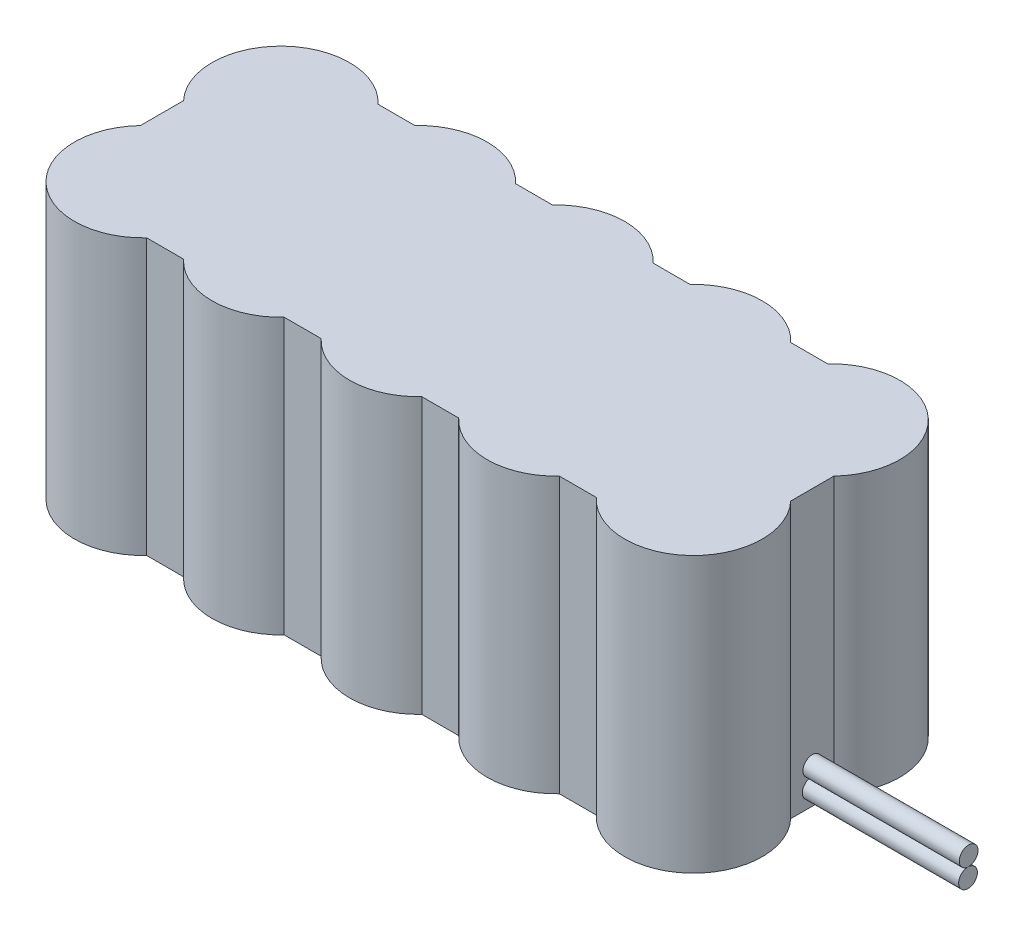
ISO-10303-21;
HEADER;
FILE_DESCRIPTION(('STEP AP214'),'2;1');
FILE_NAME('part.step','',(''),(''),'','','');
FILE_SCHEMA(('AUTOMOTIVE_DESIGN { 1 0 10303 214 1 1 1 1 }'));
ENDSEC;
DATA;
#1=APPLICATION_CONTEXT('core data for automotive mechanical design processes');
#2=APPLICATION_PROTOCOL_DEFINITION('international standard','automotive_design',2000,#1);
#3=PRODUCT_CONTEXT('',#1,'mechanical');
#4=PRODUCT('Part','Part','',(#3));
#5=PRODUCT_RELATED_PRODUCT_CATEGORY('part','',(#4));
#6=PRODUCT_DEFINITION_FORMATION('','',#4);
#7=PRODUCT_DEFINITION_CONTEXT('part definition',#1,'design');
#8=PRODUCT_DEFINITION('design','',#6,#7);
#9=PRODUCT_DEFINITION_SHAPE('','',#8);
#10=(LENGTH_UNIT() NAMED_UNIT(*) SI_UNIT(.MILLI.,.METRE.));
#11=(NAMED_UNIT(*) PLANE_ANGLE_UNIT() SI_UNIT($,.RADIAN.));
#12=(NAMED_UNIT(*) SI_UNIT($,.STERADIAN.) SOLID_ANGLE_UNIT());
#13=UNCERTAINTY_MEASURE_WITH_UNIT(LENGTH_MEASURE(1.E-05),#10,'distance_accuracy_value','');
#14=(GEOMETRIC_REPRESENTATION_CONTEXT(3) GLOBAL_UNCERTAINTY_ASSIGNED_CONTEXT((#13)) GLOBAL_UNIT_ASSIGNED_CONTEXT((#10,
#11,#12)) REPRESENTATION_CONTEXT('',''));
#15=CARTESIAN_POINT('',(0.,0.,0.));
#16=DIRECTION('',(0.,0.,1.));
#17=DIRECTION('',(1.,0.,0.));
#18=AXIS2_PLACEMENT_3D('',#15,#16,#17);
#19=CARTESIAN_POINT('',(121.,2.63932216445252,-10.9047595153091));
#20=DIRECTION('',(-1.,0.,0.));
#21=DIRECTION('',(0.,0.,1.));
#22=AXIS2_PLACEMENT_3D('',#19,#20,#21);
#23=CYLINDRICAL_SURFACE('',#22,1.5);
#24=CARTESIAN_POINT('',(121.,2.63932216445252,-10.9047595153091));
#25=DIRECTION('',(1.,0.,0.));
#26=DIRECTION('',(0.,0.,-1.));
#27=AXIS2_PLACEMENT_3D('',#24,#25,#26);
#28=CIRCLE('',#27,1.5);
#29=CARTESIAN_POINT('',(121.,2.63932216445252,-12.4047595153091));
#30=VERTEX_POINT('',#29);
#31=EDGE_CURVE('E12',#30,#30,#28,.T.);
#32=ORIENTED_EDGE('',*,*,#31,.F.);
#33=EDGE_LOOP('',(#32));
#34=FACE_BOUND('',#33,.T.);
#35=CARTESIAN_POINT('',(96.,2.63932216445252,-10.9047595153091));
#36=DIRECTION('',(1.,0.,0.));
#37=DIRECTION('',(0.,0.,-1.));
#38=AXIS2_PLACEMENT_3D('',#35,#36,#37);
#39=CIRCLE('',#38,1.5);
#40=CARTESIAN_POINT('',(96.,2.63932216445252,-12.4047595153091));
#41=VERTEX_POINT('',#40);
#42=EDGE_CURVE('E68',#41,#41,#39,.T.);
#43=ORIENTED_EDGE('',*,*,#42,.T.);
#44=EDGE_LOOP('',(#43));
#45=FACE_BOUND('',#44,.T.);
#46=ADVANCED_FACE('F65',(#34,#45),#23,.T.);
#47=CARTESIAN_POINT('',(121.,2.63932216445252,-10.9047595153091));
#48=DIRECTION('',(1.,0.,0.));
#49=DIRECTION('',(0.,0.,-1.));
#50=AXIS2_PLACEMENT_3D('',#47,#48,#49);
#51=PLANE('',#50);
#52=ORIENTED_EDGE('',*,*,#31,.T.);
#53=EDGE_LOOP('',(#52));
#54=FACE_BOUND('',#53,.T.);
#55=ADVANCED_FACE('F80',(#54),#51,.T.);
#56=CARTESIAN_POINT('',(96.,2.63932216445252,-10.9047595153091));
#57=DIRECTION('',(1.,0.,0.));
#58=DIRECTION('',(0.,0.,-1.));
#59=AXIS2_PLACEMENT_3D('',#56,#57,#58);
#60=PLANE('',#59);
#61=ORIENTED_EDGE('',*,*,#42,.F.);
#62=EDGE_LOOP('',(#61));
#63=FACE_BOUND('',#62,.T.);
#64=ADVANCED_FACE('F78',(#63),#60,.F.);
#65=CLOSED_SHELL('',(#46,#55,#64));
#66=MANIFOLD_SOLID_BREP('B2',#65);
#67=CARTESIAN_POINT('',(96.,0.,-29.5));
#68=DIRECTION('',(1.,0.,0.));
#69=DIRECTION('',(0.,0.,-1.));
#70=AXIS2_PLACEMENT_3D('',#67,#68,#69);
#71=PLANE('',#70);
#72=DIRECTION('',(0.,0.,-1.));
#73=VECTOR('',#72,1.);
#74=CARTESIAN_POINT('',(96.,0.,-29.5));
#75=LINE('',#74,#73);
#76=CARTESIAN_POINT('',(96.,0.,-7.54983443527075));
#77=VERTEX_POINT('',#76);
#78=CARTESIAN_POINT('',(96.,0.,-14.4501655647293));
#79=VERTEX_POINT('',#78);
#80=EDGE_CURVE('E349',#77,#79,#75,.T.);
#81=ORIENTED_EDGE('',*,*,#80,.T.);
#82=DIRECTION('',(0.,-1.,0.));
#83=VECTOR('',#82,1.);
#84=CARTESIAN_POINT('',(96.,44.,-14.4501655647293));
#85=LINE('',#84,#83);
#86=CARTESIAN_POINT('',(96.,44.,-14.4501655647293));
#87=VERTEX_POINT('',#86);
#88=EDGE_CURVE('E337',#79,#87,#85,.F.);
#89=ORIENTED_EDGE('',*,*,#88,.T.);
#90=DIRECTION('',(0.,0.,-1.));
#91=VECTOR('',#90,1.);
#92=CARTESIAN_POINT('',(96.,44.,-29.5));
#93=LINE('',#92,#91);
#94=CARTESIAN_POINT('',(96.,44.,-7.54983443527075));
#95=VERTEX_POINT('',#94);
#96=EDGE_CURVE('E361',#95,#87,#93,.T.);
#97=ORIENTED_EDGE('',*,*,#96,.F.);
#98=DIRECTION('',(0.,-1.,0.));
#99=VECTOR('',#98,1.);
#100=CARTESIAN_POINT('',(96.,44.,-7.54983443527075));
#101=LINE('',#100,#99);
#102=EDGE_CURVE('E371',#77,#95,#101,.F.);
#103=ORIENTED_EDGE('',*,*,#102,.F.);
#104=EDGE_LOOP('',(#81,#89,#97,#103));
#105=FACE_BOUND('',#104,.T.);
#106=CARTESIAN_POINT('',(96.,5.63932216445252,-11.));
#107=DIRECTION('',(1.,0.,0.));
#108=DIRECTION('',(0.,0.,-1.));
#109=AXIS2_PLACEMENT_3D('',#106,#107,#108);
#110=CIRCLE('',#109,1.5);
#111=CARTESIAN_POINT('',(96.,5.63932216445252,-12.5));
#112=VERTEX_POINT('',#111);
#113=EDGE_CURVE('E266',#112,#112,#110,.T.);
#114=ORIENTED_EDGE('',*,*,#113,.F.);
#115=EDGE_LOOP('',(#114));
#116=FACE_BOUND('',#115,.T.);
#117=ADVANCED_FACE('F106',(#105,#116),#71,.T.);
#118=CARTESIAN_POINT('',(-8.,0.,-29.5));
#119=DIRECTION('',(0.,0.,-1.));
#120=DIRECTION('',(-1.,0.,0.));
#121=AXIS2_PLACEMENT_3D('',#118,#119,#120);
#122=PLANE('',#121);
#123=DIRECTION('',(-1.,0.,0.));
#124=VECTOR('',#123,1.);
#125=CARTESIAN_POINT('',(-8.,0.,-29.5));
#126=LINE('',#125,#124);
#127=CARTESIAN_POINT('',(13.9532615302845,0.,-29.5));
#128=VERTEX_POINT('',#127);
#129=CARTESIAN_POINT('',(8.04673846971554,0.,-29.5));
#130=VERTEX_POINT('',#129);
#131=EDGE_CURVE('E352',#128,#130,#126,.T.);
#132=ORIENTED_EDGE('',*,*,#131,.T.);
#133=DIRECTION('',(0.,-1.,0.));
#134=VECTOR('',#133,1.);
#135=CARTESIAN_POINT('',(8.04673846971554,44.,-29.5));
#136=LINE('',#135,#134);
#137=CARTESIAN_POINT('',(8.04673846971554,44.,-29.5));
#138=VERTEX_POINT('',#137);
#139=EDGE_CURVE('E128',#130,#138,#136,.F.);
#140=ORIENTED_EDGE('',*,*,#139,.T.);
#141=DIRECTION('',(-1.,0.,0.));
#142=VECTOR('',#141,1.);
#143=CARTESIAN_POINT('',(-8.,44.,-29.5));
#144=LINE('',#143,#142);
#145=CARTESIAN_POINT('',(13.9532615302845,44.,-29.5));
#146=VERTEX_POINT('',#145);
#147=EDGE_CURVE('E365',#146,#138,#144,.T.);
#148=ORIENTED_EDGE('',*,*,#147,.F.);
#149=DIRECTION('',(0.,-1.,0.));
#150=VECTOR('',#149,1.);
#151=CARTESIAN_POINT('',(13.9532615302845,44.,-29.5));
#152=LINE('',#151,#150);
#153=EDGE_CURVE('E274',#146,#128,#152,.T.);
#154=ORIENTED_EDGE('',*,*,#153,.T.);
#155=EDGE_LOOP('',(#132,#140,#148,#154));
#156=FACE_BOUND('',#155,.T.);
#157=ADVANCED_FACE('F459',(#156),#122,.T.);
#158=CARTESIAN_POINT('',(-8.,0.,-29.5));
#159=DIRECTION('',(-1.,0.,0.));
#160=DIRECTION('',(0.,0.,1.));
#161=AXIS2_PLACEMENT_3D('',#158,#159,#160);
#162=PLANE('',#161);
#163=DIRECTION('',(0.,0.,1.));
#164=VECTOR('',#163,1.);
#165=CARTESIAN_POINT('',(-8.,44.,-29.5));
#166=LINE('',#165,#164);
#167=CARTESIAN_POINT('',(-8.,44.,-14.4501655647293));
#168=VERTEX_POINT('',#167);
#169=CARTESIAN_POINT('',(-8.,44.,-7.54983443527075));
#170=VERTEX_POINT('',#169);
#171=EDGE_CURVE('E120',#168,#170,#166,.T.);
#172=ORIENTED_EDGE('',*,*,#171,.F.);
#173=DIRECTION('',(0.,-1.,0.));
#174=VECTOR('',#173,1.);
#175=CARTESIAN_POINT('',(-8.,44.,-14.4501655647293));
#176=LINE('',#175,#174);
#177=CARTESIAN_POINT('',(-8.,0.,-14.4501655647293));
#178=VERTEX_POINT('',#177);
#179=EDGE_CURVE('E254',#168,#178,#176,.T.);
#180=ORIENTED_EDGE('',*,*,#179,.T.);
#181=DIRECTION('',(0.,0.,1.));
#182=VECTOR('',#181,1.);
#183=CARTESIAN_POINT('',(-8.,0.,-29.5));
#184=LINE('',#183,#182);
#185=CARTESIAN_POINT('',(-8.,0.,-7.54983443527075));
#186=VERTEX_POINT('',#185);
#187=EDGE_CURVE('E243',#178,#186,#184,.T.);
#188=ORIENTED_EDGE('',*,*,#187,.T.);
#189=DIRECTION('',(0.,-1.,0.));
#190=VECTOR('',#189,1.);
#191=CARTESIAN_POINT('',(-8.,44.,-7.54983443527075));
#192=LINE('',#191,#190);
#193=EDGE_CURVE('E63',#186,#170,#192,.F.);
#194=ORIENTED_EDGE('',*,*,#193,.T.);
#195=EDGE_LOOP('',(#172,#180,#188,#194));
#196=FACE_BOUND('',#195,.T.);
#197=ADVANCED_FACE('F255',(#196),#162,.T.);
#198=CARTESIAN_POINT('',(35.9532615302845,0.,-29.5));
#199=VERTEX_POINT('',#198);
#200=CARTESIAN_POINT('',(30.0467384697155,0.,-29.5));
#201=VERTEX_POINT('',#200);
#202=EDGE_CURVE('E454',#199,#201,#126,.T.);
#203=ORIENTED_EDGE('',*,*,#202,.T.);
#204=DIRECTION('',(0.,-1.,0.));
#205=VECTOR('',#204,1.);
#206=CARTESIAN_POINT('',(30.0467384697155,44.,-29.5));
#207=LINE('',#206,#205);
#208=CARTESIAN_POINT('',(30.0467384697155,44.,-29.5));
#209=VERTEX_POINT('',#208);
#210=EDGE_CURVE('E279',#201,#209,#207,.F.);
#211=ORIENTED_EDGE('',*,*,#210,.T.);
#212=CARTESIAN_POINT('',(35.9532615302845,44.,-29.5));
#213=VERTEX_POINT('',#212);
#214=EDGE_CURVE('E445',#213,#209,#144,.T.);
#215=ORIENTED_EDGE('',*,*,#214,.F.);
#216=DIRECTION('',(0.,-1.,0.));
#217=VECTOR('',#216,1.);
#218=CARTESIAN_POINT('',(35.9532615302845,44.,-29.5));
#219=LINE('',#218,#217);
#220=EDGE_CURVE('E291',#213,#199,#219,.T.);
#221=ORIENTED_EDGE('',*,*,#220,.T.);
#222=EDGE_LOOP('',(#203,#211,#215,#221));
#223=FACE_BOUND('',#222,.T.);
#224=ADVANCED_FACE('F453',(#223),#122,.T.);
#225=CARTESIAN_POINT('',(-8.,0.,7.5));
#226=DIRECTION('',(0.,0.,1.));
#227=DIRECTION('',(1.,0.,0.));
#228=AXIS2_PLACEMENT_3D('',#225,#226,#227);
#229=PLANE('',#228);
#230=DIRECTION('',(1.,0.,0.));
#231=VECTOR('',#230,1.);
#232=CARTESIAN_POINT('',(-8.,44.,7.5));
#233=LINE('',#232,#231);
#234=CARTESIAN_POINT('',(8.04673846971554,44.,7.5));
#235=VERTEX_POINT('',#234);
#236=CARTESIAN_POINT('',(13.9532615302845,44.,7.5));
#237=VERTEX_POINT('',#236);
#238=EDGE_CURVE('E359',#235,#237,#233,.T.);
#239=ORIENTED_EDGE('',*,*,#238,.F.);
#240=DIRECTION('',(0.,-1.,0.));
#241=VECTOR('',#240,1.);
#242=CARTESIAN_POINT('',(8.04673846971554,44.,7.5));
#243=LINE('',#242,#241);
#244=CARTESIAN_POINT('',(8.04673846971554,0.,7.5));
#245=VERTEX_POINT('',#244);
#246=EDGE_CURVE('E283',#235,#245,#243,.T.);
#247=ORIENTED_EDGE('',*,*,#246,.T.);
#248=DIRECTION('',(1.,0.,0.));
#249=VECTOR('',#248,1.);
#250=CARTESIAN_POINT('',(-8.,0.,7.5));
#251=LINE('',#250,#249);
#252=CARTESIAN_POINT('',(13.9532615302845,0.,7.5));
#253=VERTEX_POINT('',#252);
#254=EDGE_CURVE('E347',#245,#253,#251,.T.);
#255=ORIENTED_EDGE('',*,*,#254,.T.);
#256=DIRECTION('',(0.,-1.,0.));
#257=VECTOR('',#256,1.);
#258=CARTESIAN_POINT('',(13.9532615302845,44.,7.5));
#259=LINE('',#258,#257);
#260=EDGE_CURVE('E307',#253,#237,#259,.F.);
#261=ORIENTED_EDGE('',*,*,#260,.T.);
#262=EDGE_LOOP('',(#239,#247,#255,#261));
#263=FACE_BOUND('',#262,.T.);
#264=ADVANCED_FACE('F470',(#263),#229,.T.);
#265=CARTESIAN_POINT('',(57.9532615302845,0.,-29.5));
#266=VERTEX_POINT('',#265);
#267=CARTESIAN_POINT('',(52.0467384697155,0.,-29.5));
#268=VERTEX_POINT('',#267);
#269=EDGE_CURVE('E356',#266,#268,#126,.T.);
#270=ORIENTED_EDGE('',*,*,#269,.T.);
#271=DIRECTION('',(0.,-1.,0.));
#272=VECTOR('',#271,1.);
#273=CARTESIAN_POINT('',(52.0467384697155,44.,-29.5));
#274=LINE('',#273,#272);
#275=CARTESIAN_POINT('',(52.0467384697155,44.,-29.5));
#276=VERTEX_POINT('',#275);
#277=EDGE_CURVE('E296',#268,#276,#274,.F.);
#278=ORIENTED_EDGE('',*,*,#277,.T.);
#279=CARTESIAN_POINT('',(57.9532615302845,44.,-29.5));
#280=VERTEX_POINT('',#279);
#281=EDGE_CURVE('E368',#280,#276,#144,.T.);
#282=ORIENTED_EDGE('',*,*,#281,.F.);
#283=DIRECTION('',(0.,-1.,0.));
#284=VECTOR('',#283,1.);
#285=CARTESIAN_POINT('',(57.9532615302845,44.,-29.5));
#286=LINE('',#285,#284);
#287=EDGE_CURVE('E314',#280,#266,#286,.T.);
#288=ORIENTED_EDGE('',*,*,#287,.T.);
#289=EDGE_LOOP('',(#270,#278,#282,#288));
#290=FACE_BOUND('',#289,.T.);
#291=ADVANCED_FACE('F471',(#290),#122,.T.);
#292=CARTESIAN_POINT('',(30.0467384697155,44.,7.5));
#293=VERTEX_POINT('',#292);
#294=CARTESIAN_POINT('',(35.9532615302845,44.,7.5));
#295=VERTEX_POINT('',#294);
#296=EDGE_CURVE('E362',#293,#295,#233,.T.);
#297=ORIENTED_EDGE('',*,*,#296,.F.);
#298=DIRECTION('',(0.,-1.,0.));
#299=VECTOR('',#298,1.);
#300=CARTESIAN_POINT('',(30.0467384697155,44.,7.5));
#301=LINE('',#300,#299);
#302=CARTESIAN_POINT('',(30.0467384697155,0.,7.5));
#303=VERTEX_POINT('',#302);
#304=EDGE_CURVE('E302',#293,#303,#301,.T.);
#305=ORIENTED_EDGE('',*,*,#304,.T.);
#306=CARTESIAN_POINT('',(35.9532615302845,0.,7.5));
#307=VERTEX_POINT('',#306);
#308=EDGE_CURVE('E350',#303,#307,#251,.T.);
#309=ORIENTED_EDGE('',*,*,#308,.T.);
#310=DIRECTION('',(0.,-1.,0.));
#311=VECTOR('',#310,1.);
#312=CARTESIAN_POINT('',(35.9532615302845,44.,7.5));
#313=LINE('',#312,#311);
#314=EDGE_CURVE('E330',#307,#295,#313,.F.);
#315=ORIENTED_EDGE('',*,*,#314,.T.);
#316=EDGE_LOOP('',(#297,#305,#309,#315));
#317=FACE_BOUND('',#316,.T.);
#318=ADVANCED_FACE('F427',(#317),#229,.T.);
#319=CARTESIAN_POINT('',(79.9532615302845,0.,-29.5));
#320=VERTEX_POINT('',#319);
#321=CARTESIAN_POINT('',(74.0467384697155,0.,-29.5));
#322=VERTEX_POINT('',#321);
#323=EDGE_CURVE('E353',#320,#322,#126,.T.);
#324=ORIENTED_EDGE('',*,*,#323,.T.);
#325=DIRECTION('',(0.,-1.,0.));
#326=VECTOR('',#325,1.);
#327=CARTESIAN_POINT('',(74.0467384697155,44.,-29.5));
#328=LINE('',#327,#326);
#329=CARTESIAN_POINT('',(74.0467384697155,44.,-29.5));
#330=VERTEX_POINT('',#329);
#331=EDGE_CURVE('E319',#322,#330,#328,.F.);
#332=ORIENTED_EDGE('',*,*,#331,.T.);
#333=CARTESIAN_POINT('',(79.9532615302844,44.,-29.5));
#334=VERTEX_POINT('',#333);
#335=EDGE_CURVE('E252',#334,#330,#144,.T.);
#336=ORIENTED_EDGE('',*,*,#335,.F.);
#337=DIRECTION('',(0.,-1.,0.));
#338=VECTOR('',#337,1.);
#339=CARTESIAN_POINT('',(79.9532615302845,44.,-29.5));
#340=LINE('',#339,#338);
#341=EDGE_CURVE('E114',#334,#320,#340,.T.);
#342=ORIENTED_EDGE('',*,*,#341,.T.);
#343=EDGE_LOOP('',(#324,#332,#336,#342));
#344=FACE_BOUND('',#343,.T.);
#345=ADVANCED_FACE('F388',(#344),#122,.T.);
#346=CARTESIAN_POINT('',(52.0467384697155,44.,7.5));
#347=VERTEX_POINT('',#346);
#348=CARTESIAN_POINT('',(57.9532615302845,44.,7.5));
#349=VERTEX_POINT('',#348);
#350=EDGE_CURVE('E422',#347,#349,#233,.T.);
#351=ORIENTED_EDGE('',*,*,#350,.F.);
#352=DIRECTION('',(0.,-1.,0.));
#353=VECTOR('',#352,1.);
#354=CARTESIAN_POINT('',(52.0467384697155,44.,7.5));
#355=LINE('',#354,#353);
#356=CARTESIAN_POINT('',(52.0467384697155,0.,7.5));
#357=VERTEX_POINT('',#356);
#358=EDGE_CURVE('E325',#347,#357,#355,.T.);
#359=ORIENTED_EDGE('',*,*,#358,.T.);
#360=CARTESIAN_POINT('',(57.9532615302845,0.,7.5));
#361=VERTEX_POINT('',#360);
#362=EDGE_CURVE('E413',#357,#361,#251,.T.);
#363=ORIENTED_EDGE('',*,*,#362,.T.);
#364=DIRECTION('',(0.,-1.,0.));
#365=VECTOR('',#364,1.);
#366=CARTESIAN_POINT('',(57.9532615302845,44.,7.5));
#367=LINE('',#366,#365);
#368=EDGE_CURVE('E383',#361,#349,#367,.F.);
#369=ORIENTED_EDGE('',*,*,#368,.T.);
#370=EDGE_LOOP('',(#351,#359,#363,#369));
#371=FACE_BOUND('',#370,.T.);
#372=ADVANCED_FACE('F421',(#371),#229,.T.);
#373=CARTESIAN_POINT('',(74.0467384697155,44.,7.5));
#374=VERTEX_POINT('',#373);
#375=CARTESIAN_POINT('',(79.9532615302845,44.,7.5));
#376=VERTEX_POINT('',#375);
#377=EDGE_CURVE('E358',#374,#376,#233,.T.);
#378=ORIENTED_EDGE('',*,*,#377,.F.);
#379=DIRECTION('',(0.,-1.,0.));
#380=VECTOR('',#379,1.);
#381=CARTESIAN_POINT('',(74.0467384697155,44.,7.5));
#382=LINE('',#381,#380);
#383=CARTESIAN_POINT('',(74.0467384697155,0.,7.5));
#384=VERTEX_POINT('',#383);
#385=EDGE_CURVE('E378',#374,#384,#382,.T.);
#386=ORIENTED_EDGE('',*,*,#385,.T.);
#387=CARTESIAN_POINT('',(79.9532615302845,0.,7.5));
#388=VERTEX_POINT('',#387);
#389=EDGE_CURVE('E251',#384,#388,#251,.T.);
#390=ORIENTED_EDGE('',*,*,#389,.T.);
#391=DIRECTION('',(0.,-1.,0.));
#392=VECTOR('',#391,1.);
#393=CARTESIAN_POINT('',(79.9532615302845,44.,7.5));
#394=LINE('',#393,#392);
#395=EDGE_CURVE('E355',#376,#388,#394,.T.);
#396=ORIENTED_EDGE('',*,*,#395,.F.);
#397=EDGE_LOOP('',(#378,#386,#390,#396));
#398=FACE_BOUND('',#397,.T.);
#399=ADVANCED_FACE('F415',(#398),#229,.T.);
#400=CARTESIAN_POINT('',(88.,44.,0.));
#401=DIRECTION('',(0.,-1.,0.));
#402=DIRECTION('',(0.,0.,-1.));
#403=AXIS2_PLACEMENT_3D('',#400,#401,#402);
#404=CYLINDRICAL_SURFACE('',#403,11.);
#405=CARTESIAN_POINT('',(88.,0.,0.));
#406=DIRECTION('',(0.,1.,0.));
#407=DIRECTION('',(1.,0.,0.));
#408=AXIS2_PLACEMENT_3D('',#405,#406,#407);
#409=CIRCLE('',#408,11.);
#410=EDGE_CURVE('E374',#388,#77,#409,.T.);
#411=ORIENTED_EDGE('',*,*,#410,.T.);
#412=ORIENTED_EDGE('',*,*,#102,.T.);
#413=CARTESIAN_POINT('',(88.,44.,0.));
#414=DIRECTION('',(0.,1.,0.));
#415=DIRECTION('',(1.,0.,0.));
#416=AXIS2_PLACEMENT_3D('',#413,#414,#415);
#417=CIRCLE('',#416,11.);
#418=EDGE_CURVE('E375',#376,#95,#417,.T.);
#419=ORIENTED_EDGE('',*,*,#418,.F.);
#420=ORIENTED_EDGE('',*,*,#395,.T.);
#421=EDGE_LOOP('',(#411,#412,#419,#420));
#422=FACE_BOUND('',#421,.T.);
#423=ADVANCED_FACE('F108',(#422),#404,.T.);
#424=CARTESIAN_POINT('',(88.,44.,0.));
#425=DIRECTION('',(0.,1.,0.));
#426=DIRECTION('',(1.,0.,0.));
#427=AXIS2_PLACEMENT_3D('',#424,#425,#426);
#428=PLANE('',#427);
#429=ORIENTED_EDGE('',*,*,#147,.T.);
#430=CARTESIAN_POINT('',(0.,44.,-22.));
#431=DIRECTION('',(0.,1.,0.));
#432=DIRECTION('',(1.,0.,0.));
#433=AXIS2_PLACEMENT_3D('',#430,#431,#432);
#434=CIRCLE('',#433,11.);
#435=EDGE_CURVE('E261',#138,#168,#434,.T.);
#436=ORIENTED_EDGE('',*,*,#435,.T.);
#437=ORIENTED_EDGE('',*,*,#171,.T.);
#438=CARTESIAN_POINT('',(0.,44.,0.));
#439=DIRECTION('',(0.,1.,0.));
#440=DIRECTION('',(1.,0.,0.));
#441=AXIS2_PLACEMENT_3D('',#438,#439,#440);
#442=CIRCLE('',#441,11.);
#443=EDGE_CURVE('E281',#170,#235,#442,.T.);
#444=ORIENTED_EDGE('',*,*,#443,.T.);
#445=ORIENTED_EDGE('',*,*,#238,.T.);
#446=CARTESIAN_POINT('',(22.,44.,0.));
#447=DIRECTION('',(0.,1.,0.));
#448=DIRECTION('',(1.,0.,0.));
#449=AXIS2_PLACEMENT_3D('',#446,#447,#448);
#450=CIRCLE('',#449,11.);
#451=EDGE_CURVE('E298',#237,#293,#450,.T.);
#452=ORIENTED_EDGE('',*,*,#451,.T.);
#453=ORIENTED_EDGE('',*,*,#296,.T.);
#454=CARTESIAN_POINT('',(44.,44.,0.));
#455=DIRECTION('',(0.,1.,0.));
#456=DIRECTION('',(1.,0.,0.));
#457=AXIS2_PLACEMENT_3D('',#454,#455,#456);
#458=CIRCLE('',#457,11.);
#459=EDGE_CURVE('E321',#295,#347,#458,.T.);
#460=ORIENTED_EDGE('',*,*,#459,.T.);
#461=ORIENTED_EDGE('',*,*,#350,.T.);
#462=CARTESIAN_POINT('',(66.,44.,0.));
#463=DIRECTION('',(0.,1.,0.));
#464=DIRECTION('',(1.,0.,0.));
#465=AXIS2_PLACEMENT_3D('',#462,#463,#464);
#466=CIRCLE('',#465,11.);
#467=EDGE_CURVE('E341',#349,#374,#466,.T.);
#468=ORIENTED_EDGE('',*,*,#467,.T.);
#469=ORIENTED_EDGE('',*,*,#377,.T.);
#470=ORIENTED_EDGE('',*,*,#418,.T.);
#471=ORIENTED_EDGE('',*,*,#96,.T.);
#472=CARTESIAN_POINT('',(88.,44.,-22.));
#473=DIRECTION('',(0.,1.,0.));
#474=DIRECTION('',(1.,0.,0.));
#475=AXIS2_PLACEMENT_3D('',#472,#473,#474);
#476=CIRCLE('',#475,11.);
#477=EDGE_CURVE('E333',#87,#334,#476,.T.);
#478=ORIENTED_EDGE('',*,*,#477,.T.);
#479=ORIENTED_EDGE('',*,*,#335,.T.);
#480=CARTESIAN_POINT('',(66.,44.,-22.));
#481=DIRECTION('',(0.,1.,0.));
#482=DIRECTION('',(1.,0.,0.));
#483=AXIS2_PLACEMENT_3D('',#480,#481,#482);
#484=CIRCLE('',#483,11.);
#485=EDGE_CURVE('E310',#330,#280,#484,.T.);
#486=ORIENTED_EDGE('',*,*,#485,.T.);
#487=ORIENTED_EDGE('',*,*,#281,.T.);
#488=CARTESIAN_POINT('',(44.,44.,-22.));
#489=DIRECTION('',(0.,1.,0.));
#490=DIRECTION('',(1.,0.,0.));
#491=AXIS2_PLACEMENT_3D('',#488,#489,#490);
#492=CIRCLE('',#491,11.);
#493=EDGE_CURVE('E287',#276,#213,#492,.T.);
#494=ORIENTED_EDGE('',*,*,#493,.T.);
#495=ORIENTED_EDGE('',*,*,#214,.T.);
#496=CARTESIAN_POINT('',(22.,44.,-22.));
#497=DIRECTION('',(0.,1.,0.));
#498=DIRECTION('',(1.,0.,0.));
#499=AXIS2_PLACEMENT_3D('',#496,#497,#498);
#500=CIRCLE('',#499,11.);
#501=EDGE_CURVE('E270',#209,#146,#500,.T.);
#502=ORIENTED_EDGE('',*,*,#501,.T.);
#503=EDGE_LOOP('',(#429,#436,#437,#444,#445,#452,#453,#460,#461,#468,#469,#470,#471,#478,#479,
#486,#487,#494,#495,#502));
#504=FACE_BOUND('',#503,.T.);
#505=ADVANCED_FACE('F404',(#504),#428,.T.);
#506=CARTESIAN_POINT('',(88.,0.,0.));
#507=DIRECTION('',(0.,1.,0.));
#508=DIRECTION('',(1.,0.,0.));
#509=AXIS2_PLACEMENT_3D('',#506,#507,#508);
#510=PLANE('',#509);
#511=CARTESIAN_POINT('',(0.,0.,-22.));
#512=DIRECTION('',(0.,1.,0.));
#513=DIRECTION('',(1.,0.,0.));
#514=AXIS2_PLACEMENT_3D('',#511,#512,#513);
#515=CIRCLE('',#514,11.);
#516=EDGE_CURVE('E246',#130,#178,#515,.T.);
#517=ORIENTED_EDGE('',*,*,#516,.F.);
#518=ORIENTED_EDGE('',*,*,#131,.F.);
#519=CARTESIAN_POINT('',(22.,0.,-22.));
#520=DIRECTION('',(0.,1.,0.));
#521=DIRECTION('',(1.,0.,0.));
#522=AXIS2_PLACEMENT_3D('',#519,#520,#521);
#523=CIRCLE('',#522,11.);
#524=EDGE_CURVE('E271',#201,#128,#523,.T.);
#525=ORIENTED_EDGE('',*,*,#524,.F.);
#526=ORIENTED_EDGE('',*,*,#202,.F.);
#527=CARTESIAN_POINT('',(44.,0.,-22.));
#528=DIRECTION('',(0.,1.,0.));
#529=DIRECTION('',(1.,0.,0.));
#530=AXIS2_PLACEMENT_3D('',#527,#528,#529);
#531=CIRCLE('',#530,11.);
#532=EDGE_CURVE('E288',#268,#199,#531,.T.);
#533=ORIENTED_EDGE('',*,*,#532,.F.);
#534=ORIENTED_EDGE('',*,*,#269,.F.);
#535=CARTESIAN_POINT('',(66.,0.,-22.));
#536=DIRECTION('',(0.,1.,0.));
#537=DIRECTION('',(1.,0.,0.));
#538=AXIS2_PLACEMENT_3D('',#535,#536,#537);
#539=CIRCLE('',#538,11.);
#540=EDGE_CURVE('E311',#322,#266,#539,.T.);
#541=ORIENTED_EDGE('',*,*,#540,.F.);
#542=ORIENTED_EDGE('',*,*,#323,.F.);
#543=CARTESIAN_POINT('',(88.,0.,-22.));
#544=DIRECTION('',(0.,1.,0.));
#545=DIRECTION('',(1.,0.,0.));
#546=AXIS2_PLACEMENT_3D('',#543,#544,#545);
#547=CIRCLE('',#546,11.);
#548=EDGE_CURVE('E334',#79,#320,#547,.T.);
#549=ORIENTED_EDGE('',*,*,#548,.F.);
#550=ORIENTED_EDGE('',*,*,#80,.F.);
#551=ORIENTED_EDGE('',*,*,#410,.F.);
#552=ORIENTED_EDGE('',*,*,#389,.F.);
#553=CARTESIAN_POINT('',(66.,0.,0.));
#554=DIRECTION('',(0.,1.,0.));
#555=DIRECTION('',(1.,0.,0.));
#556=AXIS2_PLACEMENT_3D('',#553,#554,#555);
#557=CIRCLE('',#556,11.);
#558=EDGE_CURVE('E342',#361,#384,#557,.T.);
#559=ORIENTED_EDGE('',*,*,#558,.F.);
#560=ORIENTED_EDGE('',*,*,#362,.F.);
#561=CARTESIAN_POINT('',(44.,0.,0.));
#562=DIRECTION('',(0.,1.,0.));
#563=DIRECTION('',(1.,0.,0.));
#564=AXIS2_PLACEMENT_3D('',#561,#562,#563);
#565=CIRCLE('',#564,11.);
#566=EDGE_CURVE('E322',#307,#357,#565,.T.);
#567=ORIENTED_EDGE('',*,*,#566,.F.);
#568=ORIENTED_EDGE('',*,*,#308,.F.);
#569=CARTESIAN_POINT('',(22.,0.,0.));
#570=DIRECTION('',(0.,1.,0.));
#571=DIRECTION('',(1.,0.,0.));
#572=AXIS2_PLACEMENT_3D('',#569,#570,#571);
#573=CIRCLE('',#572,11.);
#574=EDGE_CURVE('E299',#253,#303,#573,.T.);
#575=ORIENTED_EDGE('',*,*,#574,.F.);
#576=ORIENTED_EDGE('',*,*,#254,.F.);
#577=CARTESIAN_POINT('',(0.,0.,0.));
#578=DIRECTION('',(0.,1.,0.));
#579=DIRECTION('',(1.,0.,0.));
#580=AXIS2_PLACEMENT_3D('',#577,#578,#579);
#581=CIRCLE('',#580,11.);
#582=EDGE_CURVE('E249',#186,#245,#581,.T.);
#583=ORIENTED_EDGE('',*,*,#582,.F.);
#584=ORIENTED_EDGE('',*,*,#187,.F.);
#585=EDGE_LOOP('',(#517,#518,#525,#526,#533,#534,#541,#542,#549,#550,#551,#552,#559,#560,#567,
#568,#575,#576,#583,#584));
#586=FACE_BOUND('',#585,.T.);
#587=ADVANCED_FACE('F244',(#586),#510,.F.);
#588=CARTESIAN_POINT('',(66.,44.,0.));
#589=DIRECTION('',(0.,-1.,0.));
#590=DIRECTION('',(0.,0.,-1.));
#591=AXIS2_PLACEMENT_3D('',#588,#589,#590);
#592=CYLINDRICAL_SURFACE('',#591,11.);
#593=ORIENTED_EDGE('',*,*,#368,.F.);
#594=ORIENTED_EDGE('',*,*,#558,.T.);
#595=ORIENTED_EDGE('',*,*,#385,.F.);
#596=ORIENTED_EDGE('',*,*,#467,.F.);
#597=EDGE_LOOP('',(#593,#594,#595,#596));
#598=FACE_BOUND('',#597,.T.);
#599=ADVANCED_FACE('F419',(#598),#592,.T.);
#600=CARTESIAN_POINT('',(88.,44.,-22.));
#601=DIRECTION('',(0.,-1.,0.));
#602=DIRECTION('',(0.,0.,-1.));
#603=AXIS2_PLACEMENT_3D('',#600,#601,#602);
#604=CYLINDRICAL_SURFACE('',#603,11.);
#605=ORIENTED_EDGE('',*,*,#88,.F.);
#606=ORIENTED_EDGE('',*,*,#548,.T.);
#607=ORIENTED_EDGE('',*,*,#341,.F.);
#608=ORIENTED_EDGE('',*,*,#477,.F.);
#609=EDGE_LOOP('',(#605,#606,#607,#608));
#610=FACE_BOUND('',#609,.T.);
#611=ADVANCED_FACE('F394',(#610),#604,.T.);
#612=CARTESIAN_POINT('',(44.,44.,0.));
#613=DIRECTION('',(0.,-1.,0.));
#614=DIRECTION('',(0.,0.,-1.));
#615=AXIS2_PLACEMENT_3D('',#612,#613,#614);
#616=CYLINDRICAL_SURFACE('',#615,11.);
#617=ORIENTED_EDGE('',*,*,#314,.F.);
#618=ORIENTED_EDGE('',*,*,#566,.T.);
#619=ORIENTED_EDGE('',*,*,#358,.F.);
#620=ORIENTED_EDGE('',*,*,#459,.F.);
#621=EDGE_LOOP('',(#617,#618,#619,#620));
#622=FACE_BOUND('',#621,.T.);
#623=ADVANCED_FACE('F432',(#622),#616,.T.);
#624=CARTESIAN_POINT('',(66.,44.,-22.));
#625=DIRECTION('',(0.,-1.,0.));
#626=DIRECTION('',(0.,0.,-1.));
#627=AXIS2_PLACEMENT_3D('',#624,#625,#626);
#628=CYLINDRICAL_SURFACE('',#627,11.);
#629=ORIENTED_EDGE('',*,*,#331,.F.);
#630=ORIENTED_EDGE('',*,*,#540,.T.);
#631=ORIENTED_EDGE('',*,*,#287,.F.);
#632=ORIENTED_EDGE('',*,*,#485,.F.);
#633=EDGE_LOOP('',(#629,#630,#631,#632));
#634=FACE_BOUND('',#633,.T.);
#635=ADVANCED_FACE('F401',(#634),#628,.T.);
#636=CARTESIAN_POINT('',(22.,44.,0.));
#637=DIRECTION('',(0.,-1.,0.));
#638=DIRECTION('',(0.,0.,-1.));
#639=AXIS2_PLACEMENT_3D('',#636,#637,#638);
#640=CYLINDRICAL_SURFACE('',#639,11.);
#641=ORIENTED_EDGE('',*,*,#260,.F.);
#642=ORIENTED_EDGE('',*,*,#574,.T.);
#643=ORIENTED_EDGE('',*,*,#304,.F.);
#644=ORIENTED_EDGE('',*,*,#451,.F.);
#645=EDGE_LOOP('',(#641,#642,#643,#644));
#646=FACE_BOUND('',#645,.T.);
#647=ADVANCED_FACE('F436',(#646),#640,.T.);
#648=CARTESIAN_POINT('',(44.,44.,-22.));
#649=DIRECTION('',(0.,-1.,0.));
#650=DIRECTION('',(0.,0.,-1.));
#651=AXIS2_PLACEMENT_3D('',#648,#649,#650);
#652=CYLINDRICAL_SURFACE('',#651,11.);
#653=ORIENTED_EDGE('',*,*,#277,.F.);
#654=ORIENTED_EDGE('',*,*,#532,.T.);
#655=ORIENTED_EDGE('',*,*,#220,.F.);
#656=ORIENTED_EDGE('',*,*,#493,.F.);
#657=EDGE_LOOP('',(#653,#654,#655,#656));
#658=FACE_BOUND('',#657,.T.);
#659=ADVANCED_FACE('F451',(#658),#652,.T.);
#660=CARTESIAN_POINT('',(0.,44.,0.));
#661=DIRECTION('',(0.,-1.,0.));
#662=DIRECTION('',(0.,0.,-1.));
#663=AXIS2_PLACEMENT_3D('',#660,#661,#662);
#664=CYLINDRICAL_SURFACE('',#663,11.);
#665=ORIENTED_EDGE('',*,*,#246,.F.);
#666=ORIENTED_EDGE('',*,*,#443,.F.);
#667=ORIENTED_EDGE('',*,*,#193,.F.);
#668=ORIENTED_EDGE('',*,*,#582,.T.);
#669=EDGE_LOOP('',(#665,#666,#667,#668));
#670=FACE_BOUND('',#669,.T.);
#671=ADVANCED_FACE('F440',(#670),#664,.T.);
#672=CARTESIAN_POINT('',(22.,44.,-22.));
#673=DIRECTION('',(0.,-1.,0.));
#674=DIRECTION('',(0.,0.,-1.));
#675=AXIS2_PLACEMENT_3D('',#672,#673,#674);
#676=CYLINDRICAL_SURFACE('',#675,11.);
#677=ORIENTED_EDGE('',*,*,#210,.F.);
#678=ORIENTED_EDGE('',*,*,#524,.T.);
#679=ORIENTED_EDGE('',*,*,#153,.F.);
#680=ORIENTED_EDGE('',*,*,#501,.F.);
#681=EDGE_LOOP('',(#677,#678,#679,#680));
#682=FACE_BOUND('',#681,.T.);
#683=ADVANCED_FACE('F458',(#682),#676,.T.);
#684=CARTESIAN_POINT('',(0.,44.,-22.));
#685=DIRECTION('',(0.,-1.,0.));
#686=DIRECTION('',(0.,0.,-1.));
#687=AXIS2_PLACEMENT_3D('',#684,#685,#686);
#688=CYLINDRICAL_SURFACE('',#687,11.);
#689=ORIENTED_EDGE('',*,*,#139,.F.);
#690=ORIENTED_EDGE('',*,*,#516,.T.);
#691=ORIENTED_EDGE('',*,*,#179,.F.);
#692=ORIENTED_EDGE('',*,*,#435,.F.);
#693=EDGE_LOOP('',(#689,#690,#691,#692));
#694=FACE_BOUND('',#693,.T.);
#695=ADVANCED_FACE('F260',(#694),#688,.T.);
#696=CARTESIAN_POINT('',(121.,5.63932216445252,-11.));
#697=DIRECTION('',(-1.,0.,0.));
#698=DIRECTION('',(0.,0.,1.));
#699=AXIS2_PLACEMENT_3D('',#696,#697,#698);
#700=CYLINDRICAL_SURFACE('',#699,1.5);
#701=CARTESIAN_POINT('',(121.,5.63932216445252,-11.));
#702=DIRECTION('',(1.,0.,0.));
#703=DIRECTION('',(0.,0.,-1.));
#704=AXIS2_PLACEMENT_3D('',#701,#702,#703);
#705=CIRCLE('',#704,1.5);
#706=CARTESIAN_POINT('',(121.,5.63932216445252,-12.5));
#707=VERTEX_POINT('',#706);
#708=EDGE_CURVE('E263',#707,#707,#705,.T.);
#709=ORIENTED_EDGE('',*,*,#708,.F.);
#710=EDGE_LOOP('',(#709));
#711=FACE_BOUND('',#710,.T.);
#712=ORIENTED_EDGE('',*,*,#113,.T.);
#713=EDGE_LOOP('',(#712));
#714=FACE_BOUND('',#713,.T.);
#715=ADVANCED_FACE('F575',(#711,#714),#700,.T.);
#716=CARTESIAN_POINT('',(121.,5.63932216445252,-11.));
#717=DIRECTION('',(1.,0.,0.));
#718=DIRECTION('',(0.,0.,-1.));
#719=AXIS2_PLACEMENT_3D('',#716,#717,#718);
#720=PLANE('',#719);
#721=ORIENTED_EDGE('',*,*,#708,.T.);
#722=EDGE_LOOP('',(#721));
#723=FACE_BOUND('',#722,.T.);
#724=ADVANCED_FACE('F593',(#723),#720,.T.);
#725=CLOSED_SHELL('',(#117,#157,#197,#224,#264,#291,#318,#345,#372,#399,#423,#505,#587,#599,
#611,#623,#635,#647,#659,#671,#683,#695,#715,#724));
#726=MANIFOLD_SOLID_BREP('B7',#725);
#727=ADVANCED_BREP_SHAPE_REPRESENTATION('',(#18,#66,#726),#14);
#728=SHAPE_DEFINITION_REPRESENTATION(#9,#727);
ENDSEC;
END-ISO-10303-21;
